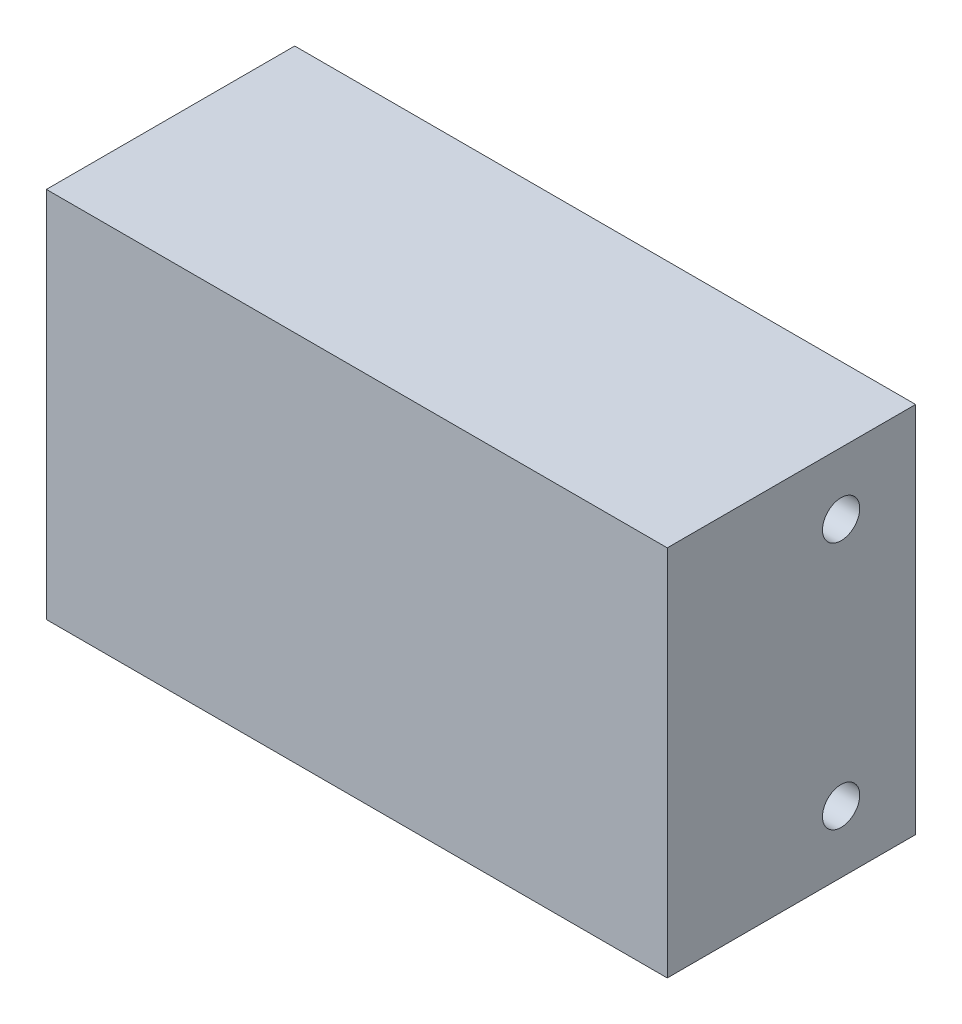
ISO-10303-21;
HEADER;
FILE_DESCRIPTION(('STEP AP214'),'2;1');
FILE_NAME('part.step','',(''),(''),'','','');
FILE_SCHEMA(('AUTOMOTIVE_DESIGN { 1 0 10303 214 1 1 1 1 }'));
ENDSEC;
DATA;
#1=APPLICATION_CONTEXT('core data for automotive mechanical design processes');
#2=APPLICATION_PROTOCOL_DEFINITION('international standard','automotive_design',2000,#1);
#3=PRODUCT_CONTEXT('',#1,'mechanical');
#4=PRODUCT('Part','Part','',(#3));
#5=PRODUCT_RELATED_PRODUCT_CATEGORY('part','',(#4));
#6=PRODUCT_DEFINITION_FORMATION('','',#4);
#7=PRODUCT_DEFINITION_CONTEXT('part definition',#1,'design');
#8=PRODUCT_DEFINITION('design','',#6,#7);
#9=PRODUCT_DEFINITION_SHAPE('','',#8);
#10=(LENGTH_UNIT() NAMED_UNIT(*) SI_UNIT(.MILLI.,.METRE.));
#11=(NAMED_UNIT(*) PLANE_ANGLE_UNIT() SI_UNIT($,.RADIAN.));
#12=(NAMED_UNIT(*) SI_UNIT($,.STERADIAN.) SOLID_ANGLE_UNIT());
#13=UNCERTAINTY_MEASURE_WITH_UNIT(LENGTH_MEASURE(1.E-05),#10,'distance_accuracy_value','');
#14=(GEOMETRIC_REPRESENTATION_CONTEXT(3) GLOBAL_UNCERTAINTY_ASSIGNED_CONTEXT((#13)) GLOBAL_UNIT_ASSIGNED_CONTEXT((#10,
#11,#12)) REPRESENTATION_CONTEXT('',''));
#15=CARTESIAN_POINT('',(0.,0.,0.));
#16=DIRECTION('',(0.,0.,1.));
#17=DIRECTION('',(1.,0.,0.));
#18=AXIS2_PLACEMENT_3D('',#15,#16,#17);
#19=CARTESIAN_POINT('',(0.,15.,0.));
#20=DIRECTION('',(1.,0.,0.));
#21=DIRECTION('',(0.,0.,-1.));
#22=AXIS2_PLACEMENT_3D('',#19,#20,#21);
#23=PLANE('',#22);
#24=CARTESIAN_POINT('',(0.,10.5,-7.));
#25=DIRECTION('',(-1.,0.,0.));
#26=DIRECTION('',(0.,0.,1.));
#27=AXIS2_PLACEMENT_3D('',#24,#25,#26);
#28=CIRCLE('',#27,0.75);
#29=CARTESIAN_POINT('',(0.,10.5,-6.25));
#30=VERTEX_POINT('',#29);
#31=EDGE_CURVE('E134',#30,#30,#28,.T.);
#32=ORIENTED_EDGE('',*,*,#31,.F.);
#33=EDGE_LOOP('',(#32));
#34=FACE_BOUND('',#33,.T.);
#35=CARTESIAN_POINT('',(0.,4.5,-7.));
#36=DIRECTION('',(-1.,0.,0.));
#37=DIRECTION('',(0.,0.,1.));
#38=AXIS2_PLACEMENT_3D('',#35,#36,#37);
#39=CIRCLE('',#38,0.749999999999999);
#40=CARTESIAN_POINT('',(0.,4.5,-6.25));
#41=VERTEX_POINT('',#40);
#42=EDGE_CURVE('E130',#41,#41,#39,.T.);
#43=ORIENTED_EDGE('',*,*,#42,.F.);
#44=EDGE_LOOP('',(#43));
#45=FACE_BOUND('',#44,.T.);
#46=DIRECTION('',(0.,0.,1.));
#47=VECTOR('',#46,1.);
#48=CARTESIAN_POINT('',(0.,0.,0.));
#49=LINE('',#48,#47);
#50=CARTESIAN_POINT('',(0.,0.,-10.));
#51=VERTEX_POINT('',#50);
#52=CARTESIAN_POINT('',(0.,0.,0.));
#53=VERTEX_POINT('',#52);
#54=EDGE_CURVE('E101',#51,#53,#49,.T.);
#55=ORIENTED_EDGE('',*,*,#54,.T.);
#56=DIRECTION('',(0.,-1.,0.));
#57=VECTOR('',#56,1.);
#58=CARTESIAN_POINT('',(0.,15.,0.));
#59=LINE('',#58,#57);
#60=CARTESIAN_POINT('',(0.,15.,0.));
#61=VERTEX_POINT('',#60);
#62=EDGE_CURVE('E11',#61,#53,#59,.T.);
#63=ORIENTED_EDGE('',*,*,#62,.F.);
#64=DIRECTION('',(0.,0.,1.));
#65=VECTOR('',#64,1.);
#66=CARTESIAN_POINT('',(0.,15.,0.));
#67=LINE('',#66,#65);
#68=CARTESIAN_POINT('',(0.,15.,-10.));
#69=VERTEX_POINT('',#68);
#70=EDGE_CURVE('E89',#69,#61,#67,.T.);
#71=ORIENTED_EDGE('',*,*,#70,.F.);
#72=DIRECTION('',(0.,-1.,0.));
#73=VECTOR('',#72,1.);
#74=CARTESIAN_POINT('',(0.,15.,-10.));
#75=LINE('',#74,#73);
#76=EDGE_CURVE('E97',#69,#51,#75,.T.);
#77=ORIENTED_EDGE('',*,*,#76,.T.);
#78=EDGE_LOOP('',(#55,#63,#71,#77));
#79=FACE_BOUND('',#78,.T.);
#80=ADVANCED_FACE('F38',(#34,#45,#79),#23,.F.);
#81=CARTESIAN_POINT('',(0.,15.,0.));
#82=DIRECTION('',(0.,0.,-1.));
#83=DIRECTION('',(-1.,0.,0.));
#84=AXIS2_PLACEMENT_3D('',#81,#82,#83);
#85=PLANE('',#84);
#86=DIRECTION('',(1.,0.,0.));
#87=VECTOR('',#86,1.);
#88=CARTESIAN_POINT('',(0.,0.,0.));
#89=LINE('',#88,#87);
#90=CARTESIAN_POINT('',(25.,0.,0.));
#91=VERTEX_POINT('',#90);
#92=EDGE_CURVE('E93',#53,#91,#89,.T.);
#93=ORIENTED_EDGE('',*,*,#92,.T.);
#94=DIRECTION('',(0.,-1.,0.));
#95=VECTOR('',#94,1.);
#96=CARTESIAN_POINT('',(25.,15.,0.));
#97=LINE('',#96,#95);
#98=CARTESIAN_POINT('',(25.,15.,0.));
#99=VERTEX_POINT('',#98);
#100=EDGE_CURVE('E46',#99,#91,#97,.T.);
#101=ORIENTED_EDGE('',*,*,#100,.F.);
#102=DIRECTION('',(1.,0.,0.));
#103=VECTOR('',#102,1.);
#104=CARTESIAN_POINT('',(0.,15.,0.));
#105=LINE('',#104,#103);
#106=EDGE_CURVE('E84',#61,#99,#105,.T.);
#107=ORIENTED_EDGE('',*,*,#106,.F.);
#108=ORIENTED_EDGE('',*,*,#62,.T.);
#109=EDGE_LOOP('',(#93,#101,#107,#108));
#110=FACE_BOUND('',#109,.T.);
#111=ADVANCED_FACE('F92',(#110),#85,.F.);
#112=CARTESIAN_POINT('',(25.,15.,0.));
#113=DIRECTION('',(-1.,0.,0.));
#114=DIRECTION('',(0.,0.,1.));
#115=AXIS2_PLACEMENT_3D('',#112,#113,#114);
#116=PLANE('',#115);
#117=CARTESIAN_POINT('',(25.,12.5,-7.));
#118=DIRECTION('',(1.,0.,0.));
#119=DIRECTION('',(0.,0.,-1.));
#120=AXIS2_PLACEMENT_3D('',#117,#118,#119);
#121=CIRCLE('',#120,0.75);
#122=CARTESIAN_POINT('',(25.,12.5,-7.75));
#123=VERTEX_POINT('',#122);
#124=EDGE_CURVE('E145',#123,#123,#121,.T.);
#125=ORIENTED_EDGE('',*,*,#124,.F.);
#126=EDGE_LOOP('',(#125));
#127=FACE_BOUND('',#126,.T.);
#128=CARTESIAN_POINT('',(25.,2.5,-7.));
#129=DIRECTION('',(1.,0.,0.));
#130=DIRECTION('',(0.,0.,-1.));
#131=AXIS2_PLACEMENT_3D('',#128,#129,#130);
#132=CIRCLE('',#131,0.749999999999998);
#133=CARTESIAN_POINT('',(25.,2.5,-7.75));
#134=VERTEX_POINT('',#133);
#135=EDGE_CURVE('E142',#134,#134,#132,.T.);
#136=ORIENTED_EDGE('',*,*,#135,.F.);
#137=EDGE_LOOP('',(#136));
#138=FACE_BOUND('',#137,.T.);
#139=DIRECTION('',(0.,0.,-1.));
#140=VECTOR('',#139,1.);
#141=CARTESIAN_POINT('',(25.,0.,0.));
#142=LINE('',#141,#140);
#143=CARTESIAN_POINT('',(25.,0.,-10.));
#144=VERTEX_POINT('',#143);
#145=EDGE_CURVE('E71',#91,#144,#142,.T.);
#146=ORIENTED_EDGE('',*,*,#145,.T.);
#147=DIRECTION('',(0.,-1.,0.));
#148=VECTOR('',#147,1.);
#149=CARTESIAN_POINT('',(25.,15.,-10.));
#150=LINE('',#149,#148);
#151=CARTESIAN_POINT('',(25.,15.,-10.));
#152=VERTEX_POINT('',#151);
#153=EDGE_CURVE('E94',#152,#144,#150,.T.);
#154=ORIENTED_EDGE('',*,*,#153,.F.);
#155=DIRECTION('',(0.,0.,-1.));
#156=VECTOR('',#155,1.);
#157=CARTESIAN_POINT('',(25.,15.,0.));
#158=LINE('',#157,#156);
#159=EDGE_CURVE('E87',#99,#152,#158,.T.);
#160=ORIENTED_EDGE('',*,*,#159,.F.);
#161=ORIENTED_EDGE('',*,*,#100,.T.);
#162=EDGE_LOOP('',(#146,#154,#160,#161));
#163=FACE_BOUND('',#162,.T.);
#164=ADVANCED_FACE('F95',(#127,#138,#163),#116,.F.);
#165=CARTESIAN_POINT('',(0.,15.,-10.));
#166=DIRECTION('',(0.,0.,1.));
#167=DIRECTION('',(1.,0.,0.));
#168=AXIS2_PLACEMENT_3D('',#165,#166,#167);
#169=PLANE('',#168);
#170=DIRECTION('',(-1.,0.,0.));
#171=VECTOR('',#170,1.);
#172=CARTESIAN_POINT('',(0.,0.,-10.));
#173=LINE('',#172,#171);
#174=EDGE_CURVE('E77',#144,#51,#173,.T.);
#175=ORIENTED_EDGE('',*,*,#174,.T.);
#176=ORIENTED_EDGE('',*,*,#76,.F.);
#177=DIRECTION('',(-1.,0.,0.));
#178=VECTOR('',#177,1.);
#179=CARTESIAN_POINT('',(0.,15.,-10.));
#180=LINE('',#179,#178);
#181=EDGE_CURVE('E54',#152,#69,#180,.T.);
#182=ORIENTED_EDGE('',*,*,#181,.F.);
#183=ORIENTED_EDGE('',*,*,#153,.T.);
#184=EDGE_LOOP('',(#175,#176,#182,#183));
#185=FACE_BOUND('',#184,.T.);
#186=ADVANCED_FACE('F109',(#185),#169,.F.);
#187=CARTESIAN_POINT('',(0.,15.,0.));
#188=DIRECTION('',(0.,-1.,0.));
#189=DIRECTION('',(0.,0.,-1.));
#190=AXIS2_PLACEMENT_3D('',#187,#188,#189);
#191=PLANE('',#190);
#192=ORIENTED_EDGE('',*,*,#70,.T.);
#193=ORIENTED_EDGE('',*,*,#106,.T.);
#194=ORIENTED_EDGE('',*,*,#159,.T.);
#195=ORIENTED_EDGE('',*,*,#181,.T.);
#196=EDGE_LOOP('',(#192,#193,#194,#195));
#197=FACE_BOUND('',#196,.T.);
#198=ADVANCED_FACE('F85',(#197),#191,.F.);
#199=CARTESIAN_POINT('',(0.,0.,0.));
#200=DIRECTION('',(0.,-1.,0.));
#201=DIRECTION('',(0.,0.,-1.));
#202=AXIS2_PLACEMENT_3D('',#199,#200,#201);
#203=PLANE('',#202);
#204=CARTESIAN_POINT('',(7.5,0.,-4.));
#205=DIRECTION('',(0.,-1.,0.));
#206=DIRECTION('',(0.,0.,-1.));
#207=AXIS2_PLACEMENT_3D('',#204,#205,#206);
#208=CIRCLE('',#207,0.749999999999999);
#209=CARTESIAN_POINT('',(7.5,0.,-4.75));
#210=VERTEX_POINT('',#209);
#211=EDGE_CURVE('E122',#210,#210,#208,.T.);
#212=ORIENTED_EDGE('',*,*,#211,.F.);
#213=EDGE_LOOP('',(#212));
#214=FACE_BOUND('',#213,.T.);
#215=CARTESIAN_POINT('',(17.5,0.,-4.));
#216=DIRECTION('',(0.,-1.,0.));
#217=DIRECTION('',(0.,0.,-1.));
#218=AXIS2_PLACEMENT_3D('',#215,#216,#217);
#219=CIRCLE('',#218,0.750000000000002);
#220=CARTESIAN_POINT('',(17.5,0.,-4.75));
#221=VERTEX_POINT('',#220);
#222=EDGE_CURVE('E118',#221,#221,#219,.T.);
#223=ORIENTED_EDGE('',*,*,#222,.F.);
#224=EDGE_LOOP('',(#223));
#225=FACE_BOUND('',#224,.T.);
#226=ORIENTED_EDGE('',*,*,#54,.F.);
#227=ORIENTED_EDGE('',*,*,#174,.F.);
#228=ORIENTED_EDGE('',*,*,#145,.F.);
#229=ORIENTED_EDGE('',*,*,#92,.F.);
#230=EDGE_LOOP('',(#226,#227,#228,#229));
#231=FACE_BOUND('',#230,.T.);
#232=ADVANCED_FACE('F112',(#214,#225,#231),#203,.T.);
#233=CARTESIAN_POINT('',(17.5,10.,-4.));
#234=DIRECTION('',(0.,-1.,0.));
#235=DIRECTION('',(0.,0.,-1.));
#236=AXIS2_PLACEMENT_3D('',#233,#234,#235);
#237=CYLINDRICAL_SURFACE('',#236,0.750000000000002);
#238=CARTESIAN_POINT('',(17.5,10.,-4.));
#239=DIRECTION('',(0.,-1.,0.));
#240=DIRECTION('',(0.,0.,-1.));
#241=AXIS2_PLACEMENT_3D('',#238,#239,#240);
#242=CIRCLE('',#241,0.750000000000002);
#243=CARTESIAN_POINT('',(17.5,10.,-4.75));
#244=VERTEX_POINT('',#243);
#245=EDGE_CURVE('E115',#244,#244,#242,.T.);
#246=ORIENTED_EDGE('',*,*,#245,.F.);
#247=EDGE_LOOP('',(#246));
#248=FACE_BOUND('',#247,.T.);
#249=ORIENTED_EDGE('',*,*,#222,.T.);
#250=EDGE_LOOP('',(#249));
#251=FACE_BOUND('',#250,.T.);
#252=ADVANCED_FACE('F211',(#248,#251),#237,.F.);
#253=CARTESIAN_POINT('',(17.5,10.,-4.));
#254=DIRECTION('',(0.,-1.,0.));
#255=DIRECTION('',(0.,0.,-1.));
#256=AXIS2_PLACEMENT_3D('',#253,#254,#255);
#257=PLANE('',#256);
#258=ORIENTED_EDGE('',*,*,#245,.T.);
#259=EDGE_LOOP('',(#258));
#260=FACE_BOUND('',#259,.T.);
#261=ADVANCED_FACE('F209',(#260),#257,.T.);
#262=CARTESIAN_POINT('',(7.5,10.,-4.));
#263=DIRECTION('',(0.,-1.,0.));
#264=DIRECTION('',(0.,0.,-1.));
#265=AXIS2_PLACEMENT_3D('',#262,#263,#264);
#266=CYLINDRICAL_SURFACE('',#265,0.749999999999999);
#267=CARTESIAN_POINT('',(7.5,10.,-4.));
#268=DIRECTION('',(0.,-1.,0.));
#269=DIRECTION('',(0.,0.,-1.));
#270=AXIS2_PLACEMENT_3D('',#267,#268,#269);
#271=CIRCLE('',#270,0.749999999999999);
#272=CARTESIAN_POINT('',(7.5,10.,-4.75));
#273=VERTEX_POINT('',#272);
#274=EDGE_CURVE('E104',#273,#273,#271,.T.);
#275=ORIENTED_EDGE('',*,*,#274,.F.);
#276=EDGE_LOOP('',(#275));
#277=FACE_BOUND('',#276,.T.);
#278=ORIENTED_EDGE('',*,*,#211,.T.);
#279=EDGE_LOOP('',(#278));
#280=FACE_BOUND('',#279,.T.);
#281=ADVANCED_FACE('F201',(#277,#280),#266,.F.);
#282=CARTESIAN_POINT('',(7.5,10.,-4.));
#283=DIRECTION('',(0.,-1.,0.));
#284=DIRECTION('',(0.,0.,-1.));
#285=AXIS2_PLACEMENT_3D('',#282,#283,#284);
#286=PLANE('',#285);
#287=ORIENTED_EDGE('',*,*,#274,.T.);
#288=EDGE_LOOP('',(#287));
#289=FACE_BOUND('',#288,.T.);
#290=ADVANCED_FACE('F192',(#289),#286,.T.);
#291=CARTESIAN_POINT('',(9.99999999999999,4.5,-7.00000000000001));
#292=DIRECTION('',(-1.,0.,0.));
#293=DIRECTION('',(0.,0.,1.));
#294=AXIS2_PLACEMENT_3D('',#291,#292,#293);
#295=CYLINDRICAL_SURFACE('',#294,0.749999999999999);
#296=CARTESIAN_POINT('',(9.99999999999999,4.5,-7.00000000000001));
#297=DIRECTION('',(-1.,0.,0.));
#298=DIRECTION('',(0.,0.,1.));
#299=AXIS2_PLACEMENT_3D('',#296,#297,#298);
#300=CIRCLE('',#299,0.749999999999999);
#301=CARTESIAN_POINT('',(9.99999999999999,4.5,-6.25000000000001));
#302=VERTEX_POINT('',#301);
#303=EDGE_CURVE('E127',#302,#302,#300,.T.);
#304=ORIENTED_EDGE('',*,*,#303,.F.);
#305=EDGE_LOOP('',(#304));
#306=FACE_BOUND('',#305,.T.);
#307=ORIENTED_EDGE('',*,*,#42,.T.);
#308=EDGE_LOOP('',(#307));
#309=FACE_BOUND('',#308,.T.);
#310=ADVANCED_FACE('F189',(#306,#309),#295,.F.);
#311=CARTESIAN_POINT('',(9.99999999999999,4.5,-7.00000000000001));
#312=DIRECTION('',(-1.,0.,0.));
#313=DIRECTION('',(0.,0.,1.));
#314=AXIS2_PLACEMENT_3D('',#311,#312,#313);
#315=PLANE('',#314);
#316=ORIENTED_EDGE('',*,*,#303,.T.);
#317=EDGE_LOOP('',(#316));
#318=FACE_BOUND('',#317,.T.);
#319=ADVANCED_FACE('F191',(#318),#315,.T.);
#320=CARTESIAN_POINT('',(9.99999999999999,10.5,-7.00000000000001));
#321=DIRECTION('',(-1.,0.,0.));
#322=DIRECTION('',(0.,0.,1.));
#323=AXIS2_PLACEMENT_3D('',#320,#321,#322);
#324=CYLINDRICAL_SURFACE('',#323,0.75);
#325=CARTESIAN_POINT('',(9.99999999999999,10.5,-7.00000000000001));
#326=DIRECTION('',(-1.,0.,0.));
#327=DIRECTION('',(0.,0.,1.));
#328=AXIS2_PLACEMENT_3D('',#325,#326,#327);
#329=CIRCLE('',#328,0.75);
#330=CARTESIAN_POINT('',(9.99999999999999,10.5,-6.25000000000001));
#331=VERTEX_POINT('',#330);
#332=EDGE_CURVE('E119',#331,#331,#329,.T.);
#333=ORIENTED_EDGE('',*,*,#332,.F.);
#334=EDGE_LOOP('',(#333));
#335=FACE_BOUND('',#334,.T.);
#336=ORIENTED_EDGE('',*,*,#31,.T.);
#337=EDGE_LOOP('',(#336));
#338=FACE_BOUND('',#337,.T.);
#339=ADVANCED_FACE('F176',(#335,#338),#324,.F.);
#340=CARTESIAN_POINT('',(9.99999999999999,10.5,-7.00000000000001));
#341=DIRECTION('',(-1.,0.,0.));
#342=DIRECTION('',(0.,0.,1.));
#343=AXIS2_PLACEMENT_3D('',#340,#341,#342);
#344=PLANE('',#343);
#345=ORIENTED_EDGE('',*,*,#332,.T.);
#346=EDGE_LOOP('',(#345));
#347=FACE_BOUND('',#346,.T.);
#348=ADVANCED_FACE('F167',(#347),#344,.T.);
#349=CARTESIAN_POINT('',(15.,2.5,-6.99999999999999));
#350=DIRECTION('',(1.,0.,0.));
#351=DIRECTION('',(0.,0.,-1.));
#352=AXIS2_PLACEMENT_3D('',#349,#350,#351);
#353=CYLINDRICAL_SURFACE('',#352,0.749999999999998);
#354=CARTESIAN_POINT('',(15.,2.5,-6.99999999999999));
#355=DIRECTION('',(1.,0.,0.));
#356=DIRECTION('',(0.,0.,-1.));
#357=AXIS2_PLACEMENT_3D('',#354,#355,#356);
#358=CIRCLE('',#357,0.749999999999998);
#359=CARTESIAN_POINT('',(15.,2.5,-7.74999999999999));
#360=VERTEX_POINT('',#359);
#361=EDGE_CURVE('E139',#360,#360,#358,.T.);
#362=ORIENTED_EDGE('',*,*,#361,.F.);
#363=EDGE_LOOP('',(#362));
#364=FACE_BOUND('',#363,.T.);
#365=ORIENTED_EDGE('',*,*,#135,.T.);
#366=EDGE_LOOP('',(#365));
#367=FACE_BOUND('',#366,.T.);
#368=ADVANCED_FACE('F165',(#364,#367),#353,.F.);
#369=CARTESIAN_POINT('',(15.,2.5,-6.99999999999999));
#370=DIRECTION('',(1.,0.,0.));
#371=DIRECTION('',(0.,0.,-1.));
#372=AXIS2_PLACEMENT_3D('',#369,#370,#371);
#373=PLANE('',#372);
#374=ORIENTED_EDGE('',*,*,#361,.T.);
#375=EDGE_LOOP('',(#374));
#376=FACE_BOUND('',#375,.T.);
#377=ADVANCED_FACE('F156',(#376),#373,.T.);
#378=CARTESIAN_POINT('',(15.,12.5,-6.99999999999999));
#379=DIRECTION('',(1.,0.,0.));
#380=DIRECTION('',(0.,0.,-1.));
#381=AXIS2_PLACEMENT_3D('',#378,#379,#380);
#382=CYLINDRICAL_SURFACE('',#381,0.75);
#383=CARTESIAN_POINT('',(15.,12.5,-6.99999999999999));
#384=DIRECTION('',(1.,0.,0.));
#385=DIRECTION('',(0.,0.,-1.));
#386=AXIS2_PLACEMENT_3D('',#383,#384,#385);
#387=CIRCLE('',#386,0.75);
#388=CARTESIAN_POINT('',(15.,12.5,-7.74999999999999));
#389=VERTEX_POINT('',#388);
#390=EDGE_CURVE('E131',#389,#389,#387,.T.);
#391=ORIENTED_EDGE('',*,*,#390,.F.);
#392=EDGE_LOOP('',(#391));
#393=FACE_BOUND('',#392,.T.);
#394=ORIENTED_EDGE('',*,*,#124,.T.);
#395=EDGE_LOOP('',(#394));
#396=FACE_BOUND('',#395,.T.);
#397=ADVANCED_FACE('F153',(#393,#396),#382,.F.);
#398=CARTESIAN_POINT('',(15.,12.5,-6.99999999999999));
#399=DIRECTION('',(1.,0.,0.));
#400=DIRECTION('',(0.,0.,-1.));
#401=AXIS2_PLACEMENT_3D('',#398,#399,#400);
#402=PLANE('',#401);
#403=ORIENTED_EDGE('',*,*,#390,.T.);
#404=EDGE_LOOP('',(#403));
#405=FACE_BOUND('',#404,.T.);
#406=ADVANCED_FACE('F151',(#405),#402,.T.);
#407=CLOSED_SHELL('',(#80,#111,#164,#186,#198,#232,#252,#261,#281,#290,#310,#319,#339,#348,#368,
#377,#397,#406));
#408=MANIFOLD_SOLID_BREP('B2',#407);
#409=ADVANCED_BREP_SHAPE_REPRESENTATION('',(#18,#408),#14);
#410=SHAPE_DEFINITION_REPRESENTATION(#9,#409);
ENDSEC;
END-ISO-10303-21;
